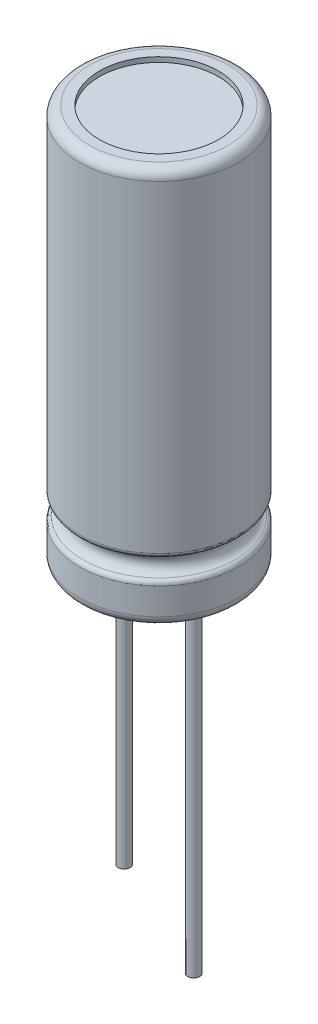
ISO-10303-21;
HEADER;
FILE_DESCRIPTION(('STEP AP214'),'2;1');
FILE_NAME('part.step','',(''),(''),'','','');
FILE_SCHEMA(('AUTOMOTIVE_DESIGN { 1 0 10303 214 1 1 1 1 }'));
ENDSEC;
DATA;
#1=APPLICATION_CONTEXT('core data for automotive mechanical design processes');
#2=APPLICATION_PROTOCOL_DEFINITION('international standard','automotive_design',2000,#1);
#3=PRODUCT_CONTEXT('',#1,'mechanical');
#4=PRODUCT('Part','Part','',(#3));
#5=PRODUCT_RELATED_PRODUCT_CATEGORY('part','',(#4));
#6=PRODUCT_DEFINITION_FORMATION('','',#4);
#7=PRODUCT_DEFINITION_CONTEXT('part definition',#1,'design');
#8=PRODUCT_DEFINITION('design','',#6,#7);
#9=PRODUCT_DEFINITION_SHAPE('','',#8);
#10=(LENGTH_UNIT() NAMED_UNIT(*) SI_UNIT(.MILLI.,.METRE.));
#11=(NAMED_UNIT(*) PLANE_ANGLE_UNIT() SI_UNIT($,.RADIAN.));
#12=(NAMED_UNIT(*) SI_UNIT($,.STERADIAN.) SOLID_ANGLE_UNIT());
#13=UNCERTAINTY_MEASURE_WITH_UNIT(LENGTH_MEASURE(1.E-05),#10,'distance_accuracy_value','');
#14=(GEOMETRIC_REPRESENTATION_CONTEXT(3) GLOBAL_UNCERTAINTY_ASSIGNED_CONTEXT((#13)) GLOBAL_UNIT_ASSIGNED_CONTEXT((#10,
#11,#12)) REPRESENTATION_CONTEXT('',''));
#15=CARTESIAN_POINT('',(0.,0.,0.));
#16=DIRECTION('',(0.,0.,1.));
#17=DIRECTION('',(1.,0.,0.));
#18=AXIS2_PLACEMENT_3D('',#15,#16,#17);
#19=CARTESIAN_POINT('',(-1.75,-17.,0.));
#20=DIRECTION('',(0.,1.,0.));
#21=DIRECTION('',(0.,0.,1.));
#22=AXIS2_PLACEMENT_3D('',#19,#20,#21);
#23=CYLINDRICAL_SURFACE('',#22,0.3);
#24=CARTESIAN_POINT('',(-1.75,0.25,0.));
#25=DIRECTION('',(0.,-1.,0.));
#26=DIRECTION('',(0.,0.,-1.));
#27=AXIS2_PLACEMENT_3D('',#24,#25,#26);
#28=CIRCLE('',#27,0.3);
#29=CARTESIAN_POINT('',(-1.75,0.25,-0.3));
#30=VERTEX_POINT('',#29);
#31=EDGE_CURVE('E65',#30,#30,#28,.T.);
#32=ORIENTED_EDGE('',*,*,#31,.T.);
#33=EDGE_LOOP('',(#32));
#34=FACE_BOUND('',#33,.T.);
#35=CARTESIAN_POINT('',(-1.75,-14.,0.));
#36=DIRECTION('',(0.,-1.,0.));
#37=DIRECTION('',(0.,0.,-1.));
#38=AXIS2_PLACEMENT_3D('',#35,#36,#37);
#39=CIRCLE('',#38,0.3);
#40=CARTESIAN_POINT('',(-1.75,-14.,-0.3));
#41=VERTEX_POINT('',#40);
#42=EDGE_CURVE('E74',#41,#41,#39,.T.);
#43=ORIENTED_EDGE('',*,*,#42,.F.);
#44=EDGE_LOOP('',(#43));
#45=FACE_BOUND('',#44,.T.);
#46=ADVANCED_FACE('F29',(#34,#45),#23,.T.);
#47=CARTESIAN_POINT('',(0.,0.25,0.));
#48=DIRECTION('',(0.,-1.,0.));
#49=DIRECTION('',(0.,0.,-1.));
#50=AXIS2_PLACEMENT_3D('',#47,#48,#49);
#51=PLANE('',#50);
#52=ORIENTED_EDGE('',*,*,#31,.F.);
#53=EDGE_LOOP('',(#52));
#54=FACE_BOUND('',#53,.T.);
#55=CARTESIAN_POINT('',(0.,0.25,0.));
#56=DIRECTION('',(0.,-1.,0.));
#57=DIRECTION('',(0.,0.,-1.));
#58=AXIS2_PLACEMENT_3D('',#55,#56,#57);
#59=CIRCLE('',#58,3.);
#60=CARTESIAN_POINT('',(0.,0.25,-3.));
#61=VERTEX_POINT('',#60);
#62=EDGE_CURVE('E61',#61,#61,#59,.T.);
#63=ORIENTED_EDGE('',*,*,#62,.T.);
#64=EDGE_LOOP('',(#63));
#65=FACE_BOUND('',#64,.T.);
#66=CARTESIAN_POINT('',(1.75,0.25,0.));
#67=DIRECTION('',(0.,-1.,0.));
#68=DIRECTION('',(0.,0.,-1.));
#69=AXIS2_PLACEMENT_3D('',#66,#67,#68);
#70=CIRCLE('',#69,0.3);
#71=CARTESIAN_POINT('',(1.75,0.25,-0.3));
#72=VERTEX_POINT('',#71);
#73=EDGE_CURVE('E71',#72,#72,#70,.T.);
#74=ORIENTED_EDGE('',*,*,#73,.F.);
#75=EDGE_LOOP('',(#74));
#76=FACE_BOUND('',#75,.T.);
#77=ADVANCED_FACE('F118',(#54,#65,#76),#51,.T.);
#78=CARTESIAN_POINT('',(0.,20.,0.));
#79=DIRECTION('',(0.,-1.,0.));
#80=DIRECTION('',(0.,0.,-1.));
#81=AXIS2_PLACEMENT_3D('',#78,#79,#80);
#82=CYLINDRICAL_SURFACE('',#81,4.);
#83=CARTESIAN_POINT('',(0.,1.84607916782785,0.));
#84=DIRECTION('',(0.,1.,0.));
#85=DIRECTION('',(0.,0.,1.));
#86=AXIS2_PLACEMENT_3D('',#83,#84,#85);
#87=CIRCLE('',#86,4.);
#88=CARTESIAN_POINT('',(0.,1.84607916782785,4.));
#89=VERTEX_POINT('',#88);
#90=EDGE_CURVE('E44',#89,#89,#87,.F.);
#91=ORIENTED_EDGE('',*,*,#90,.T.);
#92=EDGE_LOOP('',(#91));
#93=FACE_BOUND('',#92,.T.);
#94=CARTESIAN_POINT('',(0.,0.5,0.));
#95=DIRECTION('',(0.,1.,0.));
#96=DIRECTION('',(0.,0.,1.));
#97=AXIS2_PLACEMENT_3D('',#94,#95,#96);
#98=CIRCLE('',#97,4.);
#99=CARTESIAN_POINT('',(0.,0.5,4.));
#100=VERTEX_POINT('',#99);
#101=EDGE_CURVE('E58',#100,#100,#98,.T.);
#102=ORIENTED_EDGE('',*,*,#101,.T.);
#103=EDGE_LOOP('',(#102));
#104=FACE_BOUND('',#103,.T.);
#105=ADVANCED_FACE('F124',(#93,#104),#82,.T.);
#106=CARTESIAN_POINT('',(0.,0.,0.));
#107=DIRECTION('',(0.,1.,0.));
#108=DIRECTION('',(0.,0.,1.));
#109=AXIS2_PLACEMENT_3D('',#106,#107,#108);
#110=PLANE('',#109);
#111=CARTESIAN_POINT('',(0.,0.,0.));
#112=DIRECTION('',(0.,-1.,0.));
#113=DIRECTION('',(0.,0.,-1.));
#114=AXIS2_PLACEMENT_3D('',#111,#112,#113);
#115=CIRCLE('',#114,3.);
#116=CARTESIAN_POINT('',(0.,0.,-3.));
#117=VERTEX_POINT('',#116);
#118=EDGE_CURVE('E62',#117,#117,#115,.T.);
#119=ORIENTED_EDGE('',*,*,#118,.F.);
#120=EDGE_LOOP('',(#119));
#121=FACE_BOUND('',#120,.T.);
#122=CARTESIAN_POINT('',(0.,0.,0.));
#123=DIRECTION('',(0.,1.,0.));
#124=DIRECTION('',(0.,0.,1.));
#125=AXIS2_PLACEMENT_3D('',#122,#123,#124);
#126=CIRCLE('',#125,3.5);
#127=CARTESIAN_POINT('',(0.,0.,3.5));
#128=VERTEX_POINT('',#127);
#129=EDGE_CURVE('E55',#128,#128,#126,.F.);
#130=ORIENTED_EDGE('',*,*,#129,.T.);
#131=EDGE_LOOP('',(#130));
#132=FACE_BOUND('',#131,.T.);
#133=ADVANCED_FACE('F137',(#121,#132),#110,.F.);
#134=CARTESIAN_POINT('',(0.,2.5531859490144,0.));
#135=DIRECTION('',(0.,-1.,0.));
#136=DIRECTION('',(0.,0.,-1.));
#137=AXIS2_PLACEMENT_3D('',#134,#135,#136);
#138=TOROIDAL_SURFACE('',#137,4.,0.5);
#139=CARTESIAN_POINT('',(0.,2.08178142822341,0.));
#140=DIRECTION('',(0.,1.,0.));
#141=DIRECTION('',(0.,0.,1.));
#142=AXIS2_PLACEMENT_3D('',#139,#140,#141);
#143=CIRCLE('',#142,3.83333333333335);
#144=CARTESIAN_POINT('',(0.,2.08178142822341,3.83333333333335));
#145=VERTEX_POINT('',#144);
#146=EDGE_CURVE('E36',#145,#145,#143,.T.);
#147=ORIENTED_EDGE('',*,*,#146,.T.);
#148=EDGE_LOOP('',(#147));
#149=FACE_BOUND('',#148,.T.);
#150=CARTESIAN_POINT('',(0.,3.02459046980538,0.));
#151=DIRECTION('',(0.,-1.,0.));
#152=DIRECTION('',(0.,0.,-1.));
#153=AXIS2_PLACEMENT_3D('',#150,#151,#152);
#154=CIRCLE('',#153,3.83333333333335);
#155=CARTESIAN_POINT('',(0.,3.02459046980538,-3.83333333333335));
#156=VERTEX_POINT('',#155);
#157=EDGE_CURVE('E40',#156,#156,#154,.T.);
#158=ORIENTED_EDGE('',*,*,#157,.T.);
#159=EDGE_LOOP('',(#158));
#160=FACE_BOUND('',#159,.T.);
#161=ADVANCED_FACE('F99',(#149,#160),#138,.F.);
#162=CARTESIAN_POINT('',(0.,20.,0.));
#163=DIRECTION('',(0.,1.,0.));
#164=DIRECTION('',(0.,0.,1.));
#165=AXIS2_PLACEMENT_3D('',#162,#163,#164);
#166=PLANE('',#165);
#167=CARTESIAN_POINT('',(0.,20.,0.));
#168=DIRECTION('',(0.,1.,0.));
#169=DIRECTION('',(0.,0.,1.));
#170=AXIS2_PLACEMENT_3D('',#167,#168,#169);
#171=CIRCLE('',#170,3.);
#172=CARTESIAN_POINT('',(0.,20.,3.));
#173=VERTEX_POINT('',#172);
#174=EDGE_CURVE('E80',#173,#173,#171,.T.);
#175=ORIENTED_EDGE('',*,*,#174,.F.);
#176=EDGE_LOOP('',(#175));
#177=FACE_BOUND('',#176,.T.);
#178=CARTESIAN_POINT('',(0.,20.,0.));
#179=DIRECTION('',(0.,1.,0.));
#180=DIRECTION('',(0.,0.,1.));
#181=AXIS2_PLACEMENT_3D('',#178,#179,#180);
#182=CIRCLE('',#181,3.5);
#183=CARTESIAN_POINT('',(0.,20.,3.5));
#184=VERTEX_POINT('',#183);
#185=EDGE_CURVE('E52',#184,#184,#182,.T.);
#186=ORIENTED_EDGE('',*,*,#185,.T.);
#187=EDGE_LOOP('',(#186));
#188=FACE_BOUND('',#187,.T.);
#189=ADVANCED_FACE('F95',(#177,#188),#166,.T.);
#190=CARTESIAN_POINT('',(0.,3.26029273020095,0.));
#191=DIRECTION('',(0.,1.,0.));
#192=DIRECTION('',(0.,0.,1.));
#193=AXIS2_PLACEMENT_3D('',#190,#191,#192);
#194=CIRCLE('',#193,4.);
#195=CARTESIAN_POINT('',(0.,3.26029273020095,4.));
#196=VERTEX_POINT('',#195);
#197=EDGE_CURVE('E10',#196,#196,#194,.T.);
#198=ORIENTED_EDGE('',*,*,#197,.T.);
#199=EDGE_LOOP('',(#198));
#200=FACE_BOUND('',#199,.T.);
#201=CARTESIAN_POINT('',(0.,19.5,0.));
#202=DIRECTION('',(0.,1.,0.));
#203=DIRECTION('',(0.,0.,1.));
#204=AXIS2_PLACEMENT_3D('',#201,#202,#203);
#205=CIRCLE('',#204,4.);
#206=CARTESIAN_POINT('',(0.,19.5,4.));
#207=VERTEX_POINT('',#206);
#208=EDGE_CURVE('E49',#207,#207,#205,.F.);
#209=ORIENTED_EDGE('',*,*,#208,.T.);
#210=EDGE_LOOP('',(#209));
#211=FACE_BOUND('',#210,.T.);
#212=ADVANCED_FACE('F98',(#200,#211),#82,.T.);
#213=CARTESIAN_POINT('',(0.,0.5,0.));
#214=DIRECTION('',(0.,1.,0.));
#215=DIRECTION('',(0.,0.,1.));
#216=AXIS2_PLACEMENT_3D('',#213,#214,#215);
#217=TOROIDAL_SURFACE('',#216,3.5,0.5);
#218=ORIENTED_EDGE('',*,*,#129,.F.);
#219=EDGE_LOOP('',(#218));
#220=FACE_BOUND('',#219,.T.);
#221=ORIENTED_EDGE('',*,*,#101,.F.);
#222=EDGE_LOOP('',(#221));
#223=FACE_BOUND('',#222,.T.);
#224=ADVANCED_FACE('F106',(#220,#223),#217,.T.);
#225=CARTESIAN_POINT('',(0.,19.5,0.));
#226=DIRECTION('',(0.,1.,0.));
#227=DIRECTION('',(0.,0.,1.));
#228=AXIS2_PLACEMENT_3D('',#225,#226,#227);
#229=TOROIDAL_SURFACE('',#228,3.5,0.5);
#230=ORIENTED_EDGE('',*,*,#208,.F.);
#231=EDGE_LOOP('',(#230));
#232=FACE_BOUND('',#231,.T.);
#233=ORIENTED_EDGE('',*,*,#185,.F.);
#234=EDGE_LOOP('',(#233));
#235=FACE_BOUND('',#234,.T.);
#236=ADVANCED_FACE('F103',(#232,#235),#229,.T.);
#237=CARTESIAN_POINT('',(0.,1.84607916782785,0.));
#238=DIRECTION('',(0.,1.,0.));
#239=DIRECTION('',(0.,0.,1.));
#240=AXIS2_PLACEMENT_3D('',#237,#238,#239);
#241=TOROIDAL_SURFACE('',#240,3.75,0.25);
#242=ORIENTED_EDGE('',*,*,#146,.F.);
#243=EDGE_LOOP('',(#242));
#244=FACE_BOUND('',#243,.T.);
#245=ORIENTED_EDGE('',*,*,#90,.F.);
#246=EDGE_LOOP('',(#245));
#247=FACE_BOUND('',#246,.T.);
#248=ADVANCED_FACE('F105',(#244,#247),#241,.T.);
#249=CARTESIAN_POINT('',(0.,3.26029273020095,0.));
#250=DIRECTION('',(0.,1.,0.));
#251=DIRECTION('',(0.,0.,1.));
#252=AXIS2_PLACEMENT_3D('',#249,#250,#251);
#253=TOROIDAL_SURFACE('',#252,3.75,0.25);
#254=ORIENTED_EDGE('',*,*,#197,.F.);
#255=EDGE_LOOP('',(#254));
#256=FACE_BOUND('',#255,.T.);
#257=ORIENTED_EDGE('',*,*,#157,.F.);
#258=EDGE_LOOP('',(#257));
#259=FACE_BOUND('',#258,.T.);
#260=ADVANCED_FACE('F31',(#256,#259),#253,.T.);
#261=CARTESIAN_POINT('',(0.,0.25,0.));
#262=DIRECTION('',(0.,-1.,0.));
#263=DIRECTION('',(0.,0.,-1.));
#264=AXIS2_PLACEMENT_3D('',#261,#262,#263);
#265=CYLINDRICAL_SURFACE('',#264,3.);
#266=ORIENTED_EDGE('',*,*,#62,.F.);
#267=EDGE_LOOP('',(#266));
#268=FACE_BOUND('',#267,.T.);
#269=ORIENTED_EDGE('',*,*,#118,.T.);
#270=EDGE_LOOP('',(#269));
#271=FACE_BOUND('',#270,.T.);
#272=ADVANCED_FACE('F132',(#268,#271),#265,.F.);
#273=CARTESIAN_POINT('',(1.75,-17.,0.));
#274=DIRECTION('',(0.,1.,0.));
#275=DIRECTION('',(0.,0.,1.));
#276=AXIS2_PLACEMENT_3D('',#273,#274,#275);
#277=CYLINDRICAL_SURFACE('',#276,0.3);
#278=CARTESIAN_POINT('',(1.75,-17.,0.));
#279=DIRECTION('',(0.,-1.,0.));
#280=DIRECTION('',(0.,0.,-1.));
#281=AXIS2_PLACEMENT_3D('',#278,#279,#280);
#282=CIRCLE('',#281,0.3);
#283=CARTESIAN_POINT('',(1.75,-17.,-0.3));
#284=VERTEX_POINT('',#283);
#285=EDGE_CURVE('E70',#284,#284,#282,.T.);
#286=ORIENTED_EDGE('',*,*,#285,.F.);
#287=EDGE_LOOP('',(#286));
#288=FACE_BOUND('',#287,.T.);
#289=ORIENTED_EDGE('',*,*,#73,.T.);
#290=EDGE_LOOP('',(#289));
#291=FACE_BOUND('',#290,.T.);
#292=ADVANCED_FACE('F129',(#288,#291),#277,.T.);
#293=CARTESIAN_POINT('',(1.75,-17.,0.));
#294=DIRECTION('',(0.,-1.,0.));
#295=DIRECTION('',(0.,0.,-1.));
#296=AXIS2_PLACEMENT_3D('',#293,#294,#295);
#297=PLANE('',#296);
#298=ORIENTED_EDGE('',*,*,#285,.T.);
#299=EDGE_LOOP('',(#298));
#300=FACE_BOUND('',#299,.T.);
#301=ADVANCED_FACE('F205',(#300),#297,.T.);
#302=CARTESIAN_POINT('',(-1.75,-14.,0.));
#303=DIRECTION('',(0.,-1.,0.));
#304=DIRECTION('',(0.,0.,-1.));
#305=AXIS2_PLACEMENT_3D('',#302,#303,#304);
#306=PLANE('',#305);
#307=ORIENTED_EDGE('',*,*,#42,.T.);
#308=EDGE_LOOP('',(#307));
#309=FACE_BOUND('',#308,.T.);
#310=ADVANCED_FACE('F91',(#309),#306,.T.);
#311=CARTESIAN_POINT('',(0.,19.75,0.));
#312=DIRECTION('',(0.,1.,0.));
#313=DIRECTION('',(0.,0.,1.));
#314=AXIS2_PLACEMENT_3D('',#311,#312,#313);
#315=CYLINDRICAL_SURFACE('',#314,3.);
#316=CARTESIAN_POINT('',(0.,19.75,0.));
#317=DIRECTION('',(0.,1.,0.));
#318=DIRECTION('',(0.,0.,1.));
#319=AXIS2_PLACEMENT_3D('',#316,#317,#318);
#320=CIRCLE('',#319,3.);
#321=CARTESIAN_POINT('',(0.,19.75,3.));
#322=VERTEX_POINT('',#321);
#323=EDGE_CURVE('E79',#322,#322,#320,.T.);
#324=ORIENTED_EDGE('',*,*,#323,.F.);
#325=EDGE_LOOP('',(#324));
#326=FACE_BOUND('',#325,.T.);
#327=ORIENTED_EDGE('',*,*,#174,.T.);
#328=EDGE_LOOP('',(#327));
#329=FACE_BOUND('',#328,.T.);
#330=ADVANCED_FACE('F88',(#326,#329),#315,.F.);
#331=CARTESIAN_POINT('',(0.,19.75,0.));
#332=DIRECTION('',(0.,1.,0.));
#333=DIRECTION('',(0.,0.,1.));
#334=AXIS2_PLACEMENT_3D('',#331,#332,#333);
#335=PLANE('',#334);
#336=ORIENTED_EDGE('',*,*,#323,.T.);
#337=EDGE_LOOP('',(#336));
#338=FACE_BOUND('',#337,.T.);
#339=ADVANCED_FACE('F86',(#338),#335,.T.);
#340=CLOSED_SHELL('',(#46,#77,#105,#133,#161,#189,#212,#224,#236,#248,#260,#272,#292,#301,#310,
#330,#339));
#341=MANIFOLD_SOLID_BREP('B2',#340);
#342=ADVANCED_BREP_SHAPE_REPRESENTATION('',(#18,#341),#14);
#343=SHAPE_DEFINITION_REPRESENTATION(#9,#342);
ENDSEC;
END-ISO-10303-21;
